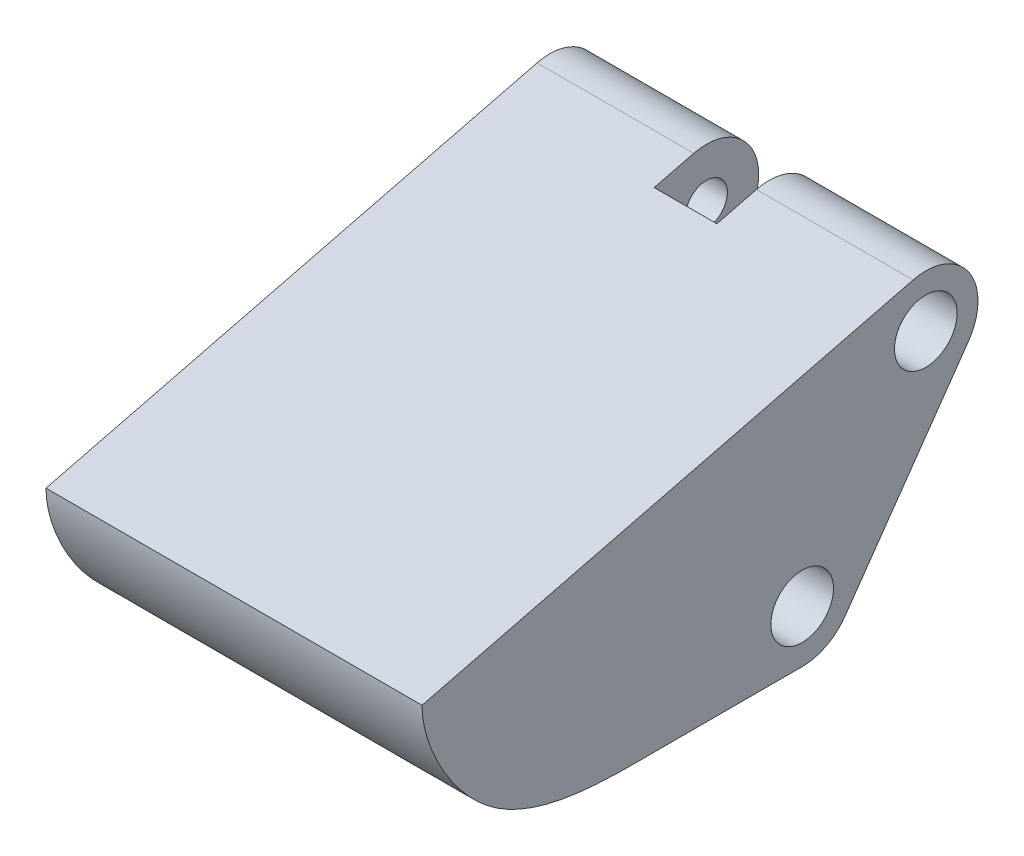
ISO-10303-21;
HEADER;
FILE_DESCRIPTION(('STEP AP214'),'2;1');
FILE_NAME('part.step','',(''),(''),'','','');
FILE_SCHEMA(('AUTOMOTIVE_DESIGN { 1 0 10303 214 1 1 1 1 }'));
ENDSEC;
DATA;
#1=APPLICATION_CONTEXT('core data for automotive mechanical design processes');
#2=APPLICATION_PROTOCOL_DEFINITION('international standard','automotive_design',2000,#1);
#3=PRODUCT_CONTEXT('',#1,'mechanical');
#4=PRODUCT('Part','Part','',(#3));
#5=PRODUCT_RELATED_PRODUCT_CATEGORY('part','',(#4));
#6=PRODUCT_DEFINITION_FORMATION('','',#4);
#7=PRODUCT_DEFINITION_CONTEXT('part definition',#1,'design');
#8=PRODUCT_DEFINITION('design','',#6,#7);
#9=PRODUCT_DEFINITION_SHAPE('','',#8);
#10=(LENGTH_UNIT() NAMED_UNIT(*) SI_UNIT(.MILLI.,.METRE.));
#11=(NAMED_UNIT(*) PLANE_ANGLE_UNIT() SI_UNIT($,.RADIAN.));
#12=(NAMED_UNIT(*) SI_UNIT($,.STERADIAN.) SOLID_ANGLE_UNIT());
#13=UNCERTAINTY_MEASURE_WITH_UNIT(LENGTH_MEASURE(1.E-05),#10,'distance_accuracy_value','');
#14=(GEOMETRIC_REPRESENTATION_CONTEXT(3) GLOBAL_UNCERTAINTY_ASSIGNED_CONTEXT((#13)) GLOBAL_UNIT_ASSIGNED_CONTEXT((#10,
#11,#12)) REPRESENTATION_CONTEXT('',''));
#15=CARTESIAN_POINT('',(0.,0.,0.));
#16=DIRECTION('',(0.,0.,1.));
#17=DIRECTION('',(1.,0.,0.));
#18=AXIS2_PLACEMENT_3D('',#15,#16,#17);
#19=CARTESIAN_POINT('',(9.,-5.00000000000001,11.8016389039334));
#20=DIRECTION('',(-1.,0.,0.));
#21=DIRECTION('',(0.,0.,1.));
#22=AXIS2_PLACEMENT_3D('',#19,#20,#21);
#23=CYLINDRICAL_SURFACE('',#22,1.);
#24=CARTESIAN_POINT('',(-3.,-5.00000000000001,11.8016389039334));
#25=DIRECTION('',(-1.,0.,0.));
#26=DIRECTION('',(0.,0.,1.));
#27=AXIS2_PLACEMENT_3D('',#24,#25,#26);
#28=CIRCLE('',#27,1.);
#29=CARTESIAN_POINT('',(-3.,-5.00000000000001,12.8016389039334));
#30=VERTEX_POINT('',#29);
#31=EDGE_CURVE('E192',#30,#30,#28,.T.);
#32=ORIENTED_EDGE('',*,*,#31,.F.);
#33=EDGE_LOOP('',(#32));
#34=FACE_BOUND('',#33,.T.);
#35=CARTESIAN_POINT('',(-6.,-5.00000000000001,11.8016389039334));
#36=DIRECTION('',(-1.,0.,0.));
#37=DIRECTION('',(0.,0.,1.));
#38=AXIS2_PLACEMENT_3D('',#35,#36,#37);
#39=CIRCLE('',#38,1.);
#40=CARTESIAN_POINT('',(-6.,-5.00000000000001,12.8016389039334));
#41=VERTEX_POINT('',#40);
#42=EDGE_CURVE('E49',#41,#41,#39,.T.);
#43=ORIENTED_EDGE('',*,*,#42,.T.);
#44=EDGE_LOOP('',(#43));
#45=FACE_BOUND('',#44,.T.);
#46=ADVANCED_FACE('F45',(#34,#45),#23,.F.);
#47=CARTESIAN_POINT('',(9.,3.45169607030982,5.88545165471655));
#48=DIRECTION('',(-1.,0.,0.));
#49=DIRECTION('',(0.,0.,1.));
#50=AXIS2_PLACEMENT_3D('',#47,#48,#49);
#51=CYLINDRICAL_SURFACE('',#50,1.);
#52=CARTESIAN_POINT('',(-1.5,3.45169607030982,5.88545165471655));
#53=DIRECTION('',(-1.,0.,0.));
#54=DIRECTION('',(0.,0.,1.));
#55=AXIS2_PLACEMENT_3D('',#52,#53,#54);
#56=CIRCLE('',#55,1.);
#57=CARTESIAN_POINT('',(-1.5,3.45169607030982,6.88545165471655));
#58=VERTEX_POINT('',#57);
#59=EDGE_CURVE('E292',#58,#58,#56,.T.);
#60=ORIENTED_EDGE('',*,*,#59,.F.);
#61=EDGE_LOOP('',(#60));
#62=FACE_BOUND('',#61,.T.);
#63=CARTESIAN_POINT('',(-6.,3.45169607030982,5.88545165471655));
#64=DIRECTION('',(-1.,0.,0.));
#65=DIRECTION('',(0.,0.,1.));
#66=AXIS2_PLACEMENT_3D('',#63,#64,#65);
#67=CIRCLE('',#66,1.);
#68=CARTESIAN_POINT('',(-6.,3.45169607030982,6.88545165471655));
#69=VERTEX_POINT('',#68);
#70=EDGE_CURVE('E203',#69,#69,#67,.T.);
#71=ORIENTED_EDGE('',*,*,#70,.T.);
#72=EDGE_LOOP('',(#71));
#73=FACE_BOUND('',#72,.T.);
#74=ADVANCED_FACE('F316',(#62,#73),#51,.F.);
#75=CARTESIAN_POINT('',(1.5,3.45169607030982,5.88545165471655));
#76=DIRECTION('',(1.,0.,0.));
#77=DIRECTION('',(0.,0.,-1.));
#78=AXIS2_PLACEMENT_3D('',#75,#76,#77);
#79=CIRCLE('',#78,1.);
#80=CARTESIAN_POINT('',(1.5,3.45169607030982,4.88545165471655));
#81=VERTEX_POINT('',#80);
#82=EDGE_CURVE('E284',#81,#81,#79,.T.);
#83=ORIENTED_EDGE('',*,*,#82,.F.);
#84=EDGE_LOOP('',(#83));
#85=FACE_BOUND('',#84,.T.);
#86=CARTESIAN_POINT('',(6.,3.45169607030982,5.88545165471655));
#87=DIRECTION('',(1.,0.,0.));
#88=DIRECTION('',(0.,0.,-1.));
#89=AXIS2_PLACEMENT_3D('',#86,#87,#88);
#90=CIRCLE('',#89,1.);
#91=CARTESIAN_POINT('',(6.,3.45169607030982,4.88545165471655));
#92=VERTEX_POINT('',#91);
#93=EDGE_CURVE('E199',#92,#92,#90,.T.);
#94=ORIENTED_EDGE('',*,*,#93,.T.);
#95=EDGE_LOOP('',(#94));
#96=FACE_BOUND('',#95,.T.);
#97=ADVANCED_FACE('F314',(#85,#96),#51,.F.);
#98=CARTESIAN_POINT('',(3.,-5.00000000000001,11.8016389039334));
#99=DIRECTION('',(1.,0.,0.));
#100=DIRECTION('',(0.,0.,-1.));
#101=AXIS2_PLACEMENT_3D('',#98,#99,#100);
#102=CIRCLE('',#101,1.);
#103=CARTESIAN_POINT('',(3.,-5.00000000000001,10.8016389039334));
#104=VERTEX_POINT('',#103);
#105=EDGE_CURVE('E187',#104,#104,#102,.T.);
#106=ORIENTED_EDGE('',*,*,#105,.F.);
#107=EDGE_LOOP('',(#106));
#108=FACE_BOUND('',#107,.T.);
#109=CARTESIAN_POINT('',(6.,-5.00000000000001,11.8016389039334));
#110=DIRECTION('',(1.,0.,0.));
#111=DIRECTION('',(0.,0.,-1.));
#112=AXIS2_PLACEMENT_3D('',#109,#110,#111);
#113=CIRCLE('',#112,1.);
#114=CARTESIAN_POINT('',(6.,-5.00000000000001,10.8016389039334));
#115=VERTEX_POINT('',#114);
#116=EDGE_CURVE('E196',#115,#115,#113,.T.);
#117=ORIENTED_EDGE('',*,*,#116,.T.);
#118=EDGE_LOOP('',(#117));
#119=FACE_BOUND('',#118,.T.);
#120=ADVANCED_FACE('F47',(#108,#119),#23,.F.);
#121=CARTESIAN_POINT('',(9.,-5.,11.8016389039334));
#122=DIRECTION('',(-1.,0.,0.));
#123=DIRECTION('',(0.,0.,1.));
#124=AXIS2_PLACEMENT_3D('',#121,#122,#123);
#125=CYLINDRICAL_SURFACE('',#124,2.5);
#126=CARTESIAN_POINT('',(-3.,-5.,11.8016389039334));
#127=DIRECTION('',(-1.,0.,0.));
#128=DIRECTION('',(0.,0.,1.));
#129=AXIS2_PLACEMENT_3D('',#126,#127,#128);
#130=CIRCLE('',#129,2.5);
#131=CARTESIAN_POINT('',(-3.,-7.50000000000001,11.8016389039334));
#132=VERTEX_POINT('',#131);
#133=CARTESIAN_POINT('',(-3.,-6.43365586090832,9.75355910263582));
#134=VERTEX_POINT('',#133);
#135=EDGE_CURVE('E269',#132,#134,#130,.F.);
#136=ORIENTED_EDGE('',*,*,#135,.F.);
#137=DIRECTION('',(-1.,0.,0.));
#138=VECTOR('',#137,1.);
#139=CARTESIAN_POINT('',(9.,-7.50000000000001,11.8016389039334));
#140=LINE('',#139,#138);
#141=CARTESIAN_POINT('',(-9.,-7.50000000000001,11.8016389039334));
#142=VERTEX_POINT('',#141);
#143=EDGE_CURVE('E131',#132,#142,#140,.T.);
#144=ORIENTED_EDGE('',*,*,#143,.T.);
#145=CARTESIAN_POINT('',(-9.,-5.,11.8016389039334));
#146=DIRECTION('',(1.,0.,0.));
#147=DIRECTION('',(0.,0.,-1.));
#148=AXIS2_PLACEMENT_3D('',#145,#146,#147);
#149=CIRCLE('',#148,2.5);
#150=CARTESIAN_POINT('',(-9.,-6.43365586090832,9.75355910263582));
#151=VERTEX_POINT('',#150);
#152=EDGE_CURVE('E161',#151,#142,#149,.F.);
#153=ORIENTED_EDGE('',*,*,#152,.F.);
#154=DIRECTION('',(-1.,0.,0.));
#155=VECTOR('',#154,1.);
#156=CARTESIAN_POINT('',(9.,-6.43365586090832,9.75355910263582));
#157=LINE('',#156,#155);
#158=EDGE_CURVE('E132',#134,#151,#157,.T.);
#159=ORIENTED_EDGE('',*,*,#158,.F.);
#160=EDGE_LOOP('',(#136,#144,#153,#159));
#161=FACE_BOUND('',#160,.T.);
#162=ADVANCED_FACE('F322',(#161),#125,.T.);
#163=CARTESIAN_POINT('',(9.,2.46644295302013,3.5234899328859));
#164=DIRECTION('',(0.,-0.573462344363328,-0.81923192051904));
#165=DIRECTION('',(0.,0.81923192051904,-0.573462344363328));
#166=AXIS2_PLACEMENT_3D('',#163,#164,#165);
#167=PLANE('',#166);
#168=DIRECTION('',(0.,0.819231920519041,-0.573462344363328));
#169=VECTOR('',#168,1.);
#170=CARTESIAN_POINT('',(-3.,2.46644295302013,3.5234899328859));
#171=LINE('',#170,#169);
#172=CARTESIAN_POINT('',(-3.,-2.25,6.825));
#173=VERTEX_POINT('',#172);
#174=EDGE_CURVE('E195',#134,#173,#171,.T.);
#175=ORIENTED_EDGE('',*,*,#174,.F.);
#176=ORIENTED_EDGE('',*,*,#158,.T.);
#177=DIRECTION('',(0.,-0.81923192051904,0.573462344363328));
#178=VECTOR('',#177,1.);
#179=CARTESIAN_POINT('',(-9.,2.46644295302013,3.5234899328859));
#180=LINE('',#179,#178);
#181=CARTESIAN_POINT('',(-9.,2.0180402094015,3.83737185341895));
#182=VERTEX_POINT('',#181);
#183=EDGE_CURVE('E164',#182,#151,#180,.T.);
#184=ORIENTED_EDGE('',*,*,#183,.F.);
#185=DIRECTION('',(-1.,0.,0.));
#186=VECTOR('',#185,1.);
#187=CARTESIAN_POINT('',(9.,2.0180402094015,3.83737185341895));
#188=LINE('',#187,#186);
#189=CARTESIAN_POINT('',(-1.5,2.0180402094015,3.83737185341895));
#190=VERTEX_POINT('',#189);
#191=EDGE_CURVE('E173',#190,#182,#188,.T.);
#192=ORIENTED_EDGE('',*,*,#191,.F.);
#193=DIRECTION('',(0.,0.81923192051904,-0.573462344363328));
#194=VECTOR('',#193,1.);
#195=CARTESIAN_POINT('',(-1.5,2.46644295302013,3.5234899328859));
#196=LINE('',#195,#194);
#197=CARTESIAN_POINT('',(-1.5,-2.25,6.825));
#198=VERTEX_POINT('',#197);
#199=EDGE_CURVE('E287',#198,#190,#196,.T.);
#200=ORIENTED_EDGE('',*,*,#199,.F.);
#201=DIRECTION('',(1.,0.,0.));
#202=VECTOR('',#201,1.);
#203=CARTESIAN_POINT('',(9.,-2.25,6.825));
#204=LINE('',#203,#202);
#205=EDGE_CURVE('E191',#173,#198,#204,.T.);
#206=ORIENTED_EDGE('',*,*,#205,.F.);
#207=EDGE_LOOP('',(#175,#176,#184,#192,#200,#206));
#208=FACE_BOUND('',#207,.T.);
#209=ADVANCED_FACE('F402',(#208),#167,.T.);
#210=CARTESIAN_POINT('',(9.,3.45169607030982,5.88545165471655));
#211=DIRECTION('',(-1.,0.,0.));
#212=DIRECTION('',(0.,0.,1.));
#213=AXIS2_PLACEMENT_3D('',#210,#211,#212);
#214=CYLINDRICAL_SURFACE('',#213,2.5);
#215=DIRECTION('',(-1.,0.,0.));
#216=VECTOR('',#215,1.);
#217=CARTESIAN_POINT('',(9.,5.87705232067315,6.49179071730738));
#218=LINE('',#217,#216);
#219=CARTESIAN_POINT('',(-1.5,5.87705232067315,6.49179071730738));
#220=VERTEX_POINT('',#219);
#221=CARTESIAN_POINT('',(-9.,5.87705232067315,6.49179071730738));
#222=VERTEX_POINT('',#221);
#223=EDGE_CURVE('E99',#220,#222,#218,.T.);
#224=ORIENTED_EDGE('',*,*,#223,.F.);
#225=CARTESIAN_POINT('',(-1.5,3.45169607030982,5.88545165471655));
#226=DIRECTION('',(-1.,0.,0.));
#227=DIRECTION('',(0.,0.,1.));
#228=AXIS2_PLACEMENT_3D('',#225,#226,#227);
#229=CIRCLE('',#228,2.5);
#230=EDGE_CURVE('E54',#220,#190,#229,.T.);
#231=ORIENTED_EDGE('',*,*,#230,.T.);
#232=ORIENTED_EDGE('',*,*,#191,.T.);
#233=CARTESIAN_POINT('',(-9.,3.45169607030982,5.88545165471655));
#234=DIRECTION('',(1.,0.,0.));
#235=DIRECTION('',(0.,0.,-1.));
#236=AXIS2_PLACEMENT_3D('',#233,#234,#235);
#237=CIRCLE('',#236,2.5);
#238=EDGE_CURVE('E167',#182,#222,#237,.T.);
#239=ORIENTED_EDGE('',*,*,#238,.T.);
#240=EDGE_LOOP('',(#224,#231,#232,#239));
#241=FACE_BOUND('',#240,.T.);
#242=ADVANCED_FACE('F313',(#241),#214,.T.);
#243=CARTESIAN_POINT('',(9.,7.05882352941176,1.76470588235294));
#244=DIRECTION('',(0.,-0.970142500145332,-0.242535625036333));
#245=DIRECTION('',(0.,0.242535625036333,-0.970142500145332));
#246=AXIS2_PLACEMENT_3D('',#243,#244,#245);
#247=PLANE('',#246);
#248=DIRECTION('',(-1.,0.,0.));
#249=VECTOR('',#248,1.);
#250=CARTESIAN_POINT('',(9.,5.40363708632086,8.38545165471655));
#251=LINE('',#250,#249);
#252=CARTESIAN_POINT('',(1.5,5.40363708632086,8.38545165471655));
#253=VERTEX_POINT('',#252);
#254=CARTESIAN_POINT('',(-1.5,5.40363708632086,8.38545165471655));
#255=VERTEX_POINT('',#254);
#256=EDGE_CURVE('E151',#253,#255,#251,.T.);
#257=ORIENTED_EDGE('',*,*,#256,.T.);
#258=DIRECTION('',(0.,0.242535625036333,-0.970142500145332));
#259=VECTOR('',#258,1.);
#260=CARTESIAN_POINT('',(-1.5,7.05882352941176,1.76470588235294));
#261=LINE('',#260,#259);
#262=EDGE_CURVE('E290',#255,#220,#261,.T.);
#263=ORIENTED_EDGE('',*,*,#262,.T.);
#264=ORIENTED_EDGE('',*,*,#223,.T.);
#265=DIRECTION('',(0.,-0.242535625036333,0.970142500145332));
#266=VECTOR('',#265,1.);
#267=CARTESIAN_POINT('',(-9.,7.05882352941176,1.76470588235294));
#268=LINE('',#267,#266);
#269=CARTESIAN_POINT('',(-9.,0.,30.));
#270=VERTEX_POINT('',#269);
#271=EDGE_CURVE('E148',#222,#270,#268,.T.);
#272=ORIENTED_EDGE('',*,*,#271,.T.);
#273=DIRECTION('',(-1.,0.,0.));
#274=VECTOR('',#273,1.);
#275=CARTESIAN_POINT('',(9.,0.,30.));
#276=LINE('',#275,#274);
#277=CARTESIAN_POINT('',(9.,0.,30.));
#278=VERTEX_POINT('',#277);
#279=EDGE_CURVE('E180',#278,#270,#276,.T.);
#280=ORIENTED_EDGE('',*,*,#279,.F.);
#281=DIRECTION('',(0.,-0.242535625036333,0.970142500145332));
#282=VECTOR('',#281,1.);
#283=CARTESIAN_POINT('',(9.,7.05882352941176,1.76470588235294));
#284=LINE('',#283,#282);
#285=CARTESIAN_POINT('',(9.,5.87705232067315,6.49179071730738));
#286=VERTEX_POINT('',#285);
#287=EDGE_CURVE('E169',#286,#278,#284,.T.);
#288=ORIENTED_EDGE('',*,*,#287,.F.);
#289=CARTESIAN_POINT('',(1.5,5.87705232067315,6.49179071730738));
#290=VERTEX_POINT('',#289);
#291=EDGE_CURVE('E170',#286,#290,#218,.T.);
#292=ORIENTED_EDGE('',*,*,#291,.T.);
#293=DIRECTION('',(0.,-0.242535625036333,0.970142500145332));
#294=VECTOR('',#293,1.);
#295=CARTESIAN_POINT('',(1.5,7.05882352941176,1.76470588235294));
#296=LINE('',#295,#294);
#297=EDGE_CURVE('E281',#290,#253,#296,.T.);
#298=ORIENTED_EDGE('',*,*,#297,.T.);
#299=EDGE_LOOP('',(#257,#263,#264,#272,#280,#288,#292,#298));
#300=FACE_BOUND('',#299,.T.);
#301=ADVANCED_FACE('F310',(#300),#247,.F.);
#302=CARTESIAN_POINT('',(9.,0.,30.));
#303=CARTESIAN_POINT('',(9.,-1.82510775769576,30.));
#304=CARTESIAN_POINT('',(9.,-7.80596294742245,26.893202647843));
#305=CARTESIAN_POINT('',(9.,-7.5,20.772810337284));
#306=CARTESIAN_POINT('',(9.,-7.5,18.5));
#307=B_SPLINE_CURVE_WITH_KNOTS('',3,(#302,#303,#304,#305,#306),.UNSPECIFIED.,.F.,.F.,(4,1,4),
(0.,0.460452824244681,1.),.UNSPECIFIED.);
#308=DIRECTION('',(-1.,0.,0.));
#309=VECTOR('',#308,1.);
#310=SURFACE_OF_LINEAR_EXTRUSION('',#307,#309);
#311=CARTESIAN_POINT('',(-9.,0.,30.));
#312=CARTESIAN_POINT('',(-9.,-1.82510775769576,30.));
#313=CARTESIAN_POINT('',(-9.,-7.80596294742245,26.893202647843));
#314=CARTESIAN_POINT('',(-9.,-7.5,20.772810337284));
#315=CARTESIAN_POINT('',(-9.,-7.5,18.5));
#316=B_SPLINE_CURVE_WITH_KNOTS('',3,(#311,#312,#313,#314,#315),.UNSPECIFIED.,.F.,.F.,(4,1,4),
(0.,0.460452824244681,1.),.UNSPECIFIED.);
#317=CARTESIAN_POINT('',(-9.,-7.50000000000001,18.5));
#318=VERTEX_POINT('',#317);
#319=EDGE_CURVE('E150',#270,#318,#316,.T.);
#320=ORIENTED_EDGE('',*,*,#319,.T.);
#321=DIRECTION('',(-1.,0.,0.));
#322=VECTOR('',#321,1.);
#323=CARTESIAN_POINT('',(9.,-7.50000000000001,18.5));
#324=LINE('',#323,#322);
#325=CARTESIAN_POINT('',(9.,-7.50000000000001,18.5));
#326=VERTEX_POINT('',#325);
#327=EDGE_CURVE('E177',#326,#318,#324,.T.);
#328=ORIENTED_EDGE('',*,*,#327,.F.);
#329=EDGE_CURVE('E108',#278,#326,#307,.T.);
#330=ORIENTED_EDGE('',*,*,#329,.F.);
#331=ORIENTED_EDGE('',*,*,#279,.T.);
#332=EDGE_LOOP('',(#320,#328,#330,#331));
#333=FACE_BOUND('',#332,.T.);
#334=ADVANCED_FACE('F305',(#333),#310,.F.);
#335=CARTESIAN_POINT('',(9.,-7.5,0.));
#336=DIRECTION('',(0.,1.,0.));
#337=DIRECTION('',(0.,0.,1.));
#338=AXIS2_PLACEMENT_3D('',#335,#336,#337);
#339=PLANE('',#338);
#340=ORIENTED_EDGE('',*,*,#143,.F.);
#341=DIRECTION('',(0.,0.,-1.));
#342=VECTOR('',#341,1.);
#343=CARTESIAN_POINT('',(-3.,-7.5,5.80163890393343));
#344=LINE('',#343,#342);
#345=CARTESIAN_POINT('',(-3.,-7.50000000000001,15.8016389039334));
#346=VERTEX_POINT('',#345);
#347=EDGE_CURVE('E202',#346,#132,#344,.T.);
#348=ORIENTED_EDGE('',*,*,#347,.F.);
#349=DIRECTION('',(-1.,0.,0.));
#350=VECTOR('',#349,1.);
#351=CARTESIAN_POINT('',(-3.,-7.50000000000001,15.8016389039334));
#352=LINE('',#351,#350);
#353=CARTESIAN_POINT('',(3.,-7.50000000000001,15.8016389039334));
#354=VERTEX_POINT('',#353);
#355=EDGE_CURVE('E238',#354,#346,#352,.T.);
#356=ORIENTED_EDGE('',*,*,#355,.F.);
#357=DIRECTION('',(0.,0.,1.));
#358=VECTOR('',#357,1.);
#359=CARTESIAN_POINT('',(3.,-7.5,5.80163890393343));
#360=LINE('',#359,#358);
#361=CARTESIAN_POINT('',(3.,-7.50000000000001,11.8016389039334));
#362=VERTEX_POINT('',#361);
#363=EDGE_CURVE('E247',#362,#354,#360,.T.);
#364=ORIENTED_EDGE('',*,*,#363,.F.);
#365=CARTESIAN_POINT('',(9.,-7.50000000000001,11.8016389039334));
#366=VERTEX_POINT('',#365);
#367=EDGE_CURVE('E175',#366,#362,#140,.T.);
#368=ORIENTED_EDGE('',*,*,#367,.F.);
#369=DIRECTION('',(0.,0.,-1.));
#370=VECTOR('',#369,1.);
#371=CARTESIAN_POINT('',(9.,-7.5,0.));
#372=LINE('',#371,#370);
#373=EDGE_CURVE('E137',#326,#366,#372,.T.);
#374=ORIENTED_EDGE('',*,*,#373,.F.);
#375=ORIENTED_EDGE('',*,*,#327,.T.);
#376=DIRECTION('',(0.,0.,-1.));
#377=VECTOR('',#376,1.);
#378=CARTESIAN_POINT('',(-9.,-7.5,0.));
#379=LINE('',#378,#377);
#380=EDGE_CURVE('E155',#318,#142,#379,.T.);
#381=ORIENTED_EDGE('',*,*,#380,.T.);
#382=EDGE_LOOP('',(#340,#348,#356,#364,#368,#374,#375,#381));
#383=FACE_BOUND('',#382,.T.);
#384=ADVANCED_FACE('F309',(#383),#339,.F.);
#385=CARTESIAN_POINT('',(3.,-5.,11.8016389039334));
#386=DIRECTION('',(1.,0.,0.));
#387=DIRECTION('',(0.,0.,-1.));
#388=AXIS2_PLACEMENT_3D('',#385,#386,#387);
#389=CIRCLE('',#388,2.5);
#390=CARTESIAN_POINT('',(3.,-6.43365586090832,9.75355910263582));
#391=VERTEX_POINT('',#390);
#392=EDGE_CURVE('E127',#391,#362,#389,.F.);
#393=ORIENTED_EDGE('',*,*,#392,.F.);
#394=CARTESIAN_POINT('',(9.,-6.43365586090832,9.75355910263582));
#395=VERTEX_POINT('',#394);
#396=EDGE_CURVE('E120',#395,#391,#157,.T.);
#397=ORIENTED_EDGE('',*,*,#396,.F.);
#398=CARTESIAN_POINT('',(9.,-5.,11.8016389039334));
#399=DIRECTION('',(1.,0.,0.));
#400=DIRECTION('',(0.,0.,-1.));
#401=AXIS2_PLACEMENT_3D('',#398,#399,#400);
#402=CIRCLE('',#401,2.5);
#403=EDGE_CURVE('E124',#395,#366,#402,.F.);
#404=ORIENTED_EDGE('',*,*,#403,.T.);
#405=ORIENTED_EDGE('',*,*,#367,.T.);
#406=EDGE_LOOP('',(#393,#397,#404,#405));
#407=FACE_BOUND('',#406,.T.);
#408=ADVANCED_FACE('F122',(#407),#125,.T.);
#409=DIRECTION('',(0.,-0.819231920519041,0.573462344363328));
#410=VECTOR('',#409,1.);
#411=CARTESIAN_POINT('',(3.,2.46644295302013,3.5234899328859));
#412=LINE('',#411,#410);
#413=CARTESIAN_POINT('',(3.,-2.25,6.825));
#414=VERTEX_POINT('',#413);
#415=EDGE_CURVE('E190',#414,#391,#412,.T.);
#416=ORIENTED_EDGE('',*,*,#415,.F.);
#417=CARTESIAN_POINT('',(1.5,-2.25,6.825));
#418=VERTEX_POINT('',#417);
#419=EDGE_CURVE('E258',#418,#414,#204,.T.);
#420=ORIENTED_EDGE('',*,*,#419,.F.);
#421=DIRECTION('',(0.,-0.81923192051904,0.573462344363328));
#422=VECTOR('',#421,1.);
#423=CARTESIAN_POINT('',(1.5,2.46644295302013,3.5234899328859));
#424=LINE('',#423,#422);
#425=CARTESIAN_POINT('',(1.5,2.0180402094015,3.83737185341895));
#426=VERTEX_POINT('',#425);
#427=EDGE_CURVE('E276',#426,#418,#424,.T.);
#428=ORIENTED_EDGE('',*,*,#427,.F.);
#429=CARTESIAN_POINT('',(9.,2.0180402094015,3.83737185341895));
#430=VERTEX_POINT('',#429);
#431=EDGE_CURVE('E143',#430,#426,#188,.T.);
#432=ORIENTED_EDGE('',*,*,#431,.F.);
#433=DIRECTION('',(0.,-0.81923192051904,0.573462344363328));
#434=VECTOR('',#433,1.);
#435=CARTESIAN_POINT('',(9.,2.46644295302013,3.5234899328859));
#436=LINE('',#435,#434);
#437=EDGE_CURVE('E135',#430,#395,#436,.T.);
#438=ORIENTED_EDGE('',*,*,#437,.T.);
#439=ORIENTED_EDGE('',*,*,#396,.T.);
#440=EDGE_LOOP('',(#416,#420,#428,#432,#438,#439));
#441=FACE_BOUND('',#440,.T.);
#442=ADVANCED_FACE('F140',(#441),#167,.T.);
#443=ORIENTED_EDGE('',*,*,#431,.T.);
#444=CARTESIAN_POINT('',(1.5,3.45169607030982,5.88545165471655));
#445=DIRECTION('',(1.,0.,0.));
#446=DIRECTION('',(0.,0.,-1.));
#447=AXIS2_PLACEMENT_3D('',#444,#445,#446);
#448=CIRCLE('',#447,2.5);
#449=EDGE_CURVE('E182',#426,#290,#448,.T.);
#450=ORIENTED_EDGE('',*,*,#449,.T.);
#451=ORIENTED_EDGE('',*,*,#291,.F.);
#452=CARTESIAN_POINT('',(9.,3.45169607030982,5.88545165471655));
#453=DIRECTION('',(1.,0.,0.));
#454=DIRECTION('',(0.,0.,-1.));
#455=AXIS2_PLACEMENT_3D('',#452,#453,#454);
#456=CIRCLE('',#455,2.5);
#457=EDGE_CURVE('E70',#430,#286,#456,.T.);
#458=ORIENTED_EDGE('',*,*,#457,.F.);
#459=EDGE_LOOP('',(#443,#450,#451,#458));
#460=FACE_BOUND('',#459,.T.);
#461=ADVANCED_FACE('F441',(#460),#214,.T.);
#462=CARTESIAN_POINT('',(9.,0.,0.));
#463=DIRECTION('',(1.,0.,0.));
#464=DIRECTION('',(0.,0.,-1.));
#465=AXIS2_PLACEMENT_3D('',#462,#463,#464);
#466=PLANE('',#465);
#467=CARTESIAN_POINT('',(9.,3.45169607030982,5.88545165471655));
#468=DIRECTION('',(1.,0.,0.));
#469=DIRECTION('',(0.,0.,-1.));
#470=AXIS2_PLACEMENT_3D('',#467,#468,#469);
#471=CIRCLE('',#470,1.5);
#472=CARTESIAN_POINT('',(9.,3.45169607030982,4.38545165471655));
#473=VERTEX_POINT('',#472);
#474=EDGE_CURVE('E226',#473,#473,#471,.T.);
#475=ORIENTED_EDGE('',*,*,#474,.F.);
#476=EDGE_LOOP('',(#475));
#477=FACE_BOUND('',#476,.T.);
#478=CARTESIAN_POINT('',(9.,-5.00000000000001,11.8016389039334));
#479=DIRECTION('',(1.,0.,0.));
#480=DIRECTION('',(0.,0.,-1.));
#481=AXIS2_PLACEMENT_3D('',#478,#479,#480);
#482=CIRCLE('',#481,1.5);
#483=CARTESIAN_POINT('',(9.,-5.00000000000001,10.3016389039334));
#484=VERTEX_POINT('',#483);
#485=EDGE_CURVE('E229',#484,#484,#482,.T.);
#486=ORIENTED_EDGE('',*,*,#485,.F.);
#487=EDGE_LOOP('',(#486));
#488=FACE_BOUND('',#487,.T.);
#489=ORIENTED_EDGE('',*,*,#287,.T.);
#490=ORIENTED_EDGE('',*,*,#329,.T.);
#491=ORIENTED_EDGE('',*,*,#373,.T.);
#492=ORIENTED_EDGE('',*,*,#403,.F.);
#493=ORIENTED_EDGE('',*,*,#437,.F.);
#494=ORIENTED_EDGE('',*,*,#457,.T.);
#495=EDGE_LOOP('',(#489,#490,#491,#492,#493,#494));
#496=FACE_BOUND('',#495,.T.);
#497=ADVANCED_FACE('F134',(#477,#488,#496),#466,.T.);
#498=CARTESIAN_POINT('',(-9.,0.,0.));
#499=DIRECTION('',(1.,0.,0.));
#500=DIRECTION('',(0.,0.,-1.));
#501=AXIS2_PLACEMENT_3D('',#498,#499,#500);
#502=PLANE('',#501);
#503=CARTESIAN_POINT('',(-9.,3.45169607030982,5.88545165471655));
#504=DIRECTION('',(-1.,0.,0.));
#505=DIRECTION('',(0.,0.,1.));
#506=AXIS2_PLACEMENT_3D('',#503,#504,#505);
#507=CIRCLE('',#506,1.5);
#508=CARTESIAN_POINT('',(-9.,3.45169607030982,7.38545165471655));
#509=VERTEX_POINT('',#508);
#510=EDGE_CURVE('E211',#509,#509,#507,.T.);
#511=ORIENTED_EDGE('',*,*,#510,.F.);
#512=EDGE_LOOP('',(#511));
#513=FACE_BOUND('',#512,.T.);
#514=CARTESIAN_POINT('',(-9.,-5.00000000000001,11.8016389039334));
#515=DIRECTION('',(-1.,0.,0.));
#516=DIRECTION('',(0.,0.,1.));
#517=AXIS2_PLACEMENT_3D('',#514,#515,#516);
#518=CIRCLE('',#517,1.5);
#519=CARTESIAN_POINT('',(-9.,-5.00000000000001,13.3016389039334));
#520=VERTEX_POINT('',#519);
#521=EDGE_CURVE('E216',#520,#520,#518,.T.);
#522=ORIENTED_EDGE('',*,*,#521,.F.);
#523=EDGE_LOOP('',(#522));
#524=FACE_BOUND('',#523,.T.);
#525=ORIENTED_EDGE('',*,*,#271,.F.);
#526=ORIENTED_EDGE('',*,*,#238,.F.);
#527=ORIENTED_EDGE('',*,*,#183,.T.);
#528=ORIENTED_EDGE('',*,*,#152,.T.);
#529=ORIENTED_EDGE('',*,*,#380,.F.);
#530=ORIENTED_EDGE('',*,*,#319,.F.);
#531=EDGE_LOOP('',(#525,#526,#527,#528,#529,#530));
#532=FACE_BOUND('',#531,.T.);
#533=ADVANCED_FACE('F351',(#513,#524,#532),#502,.F.);
#534=CARTESIAN_POINT('',(1.5,-9.04830392969018,8.38545165471655));
#535=DIRECTION('',(0.,0.,1.));
#536=DIRECTION('',(1.,0.,0.));
#537=AXIS2_PLACEMENT_3D('',#534,#535,#536);
#538=PLANE('',#537);
#539=DIRECTION('',(0.,1.,0.));
#540=VECTOR('',#539,1.);
#541=CARTESIAN_POINT('',(1.5,-9.04830392969018,8.38545165471655));
#542=LINE('',#541,#540);
#543=CARTESIAN_POINT('',(1.5,-2.25,8.38545165471655));
#544=VERTEX_POINT('',#543);
#545=EDGE_CURVE('E273',#544,#253,#542,.T.);
#546=ORIENTED_EDGE('',*,*,#545,.F.);
#547=DIRECTION('',(-1.,0.,0.));
#548=VECTOR('',#547,1.);
#549=CARTESIAN_POINT('',(1.5,-2.25,8.38545165471655));
#550=LINE('',#549,#548);
#551=CARTESIAN_POINT('',(-1.5,-2.25,8.38545165471655));
#552=VERTEX_POINT('',#551);
#553=EDGE_CURVE('E62',#544,#552,#550,.T.);
#554=ORIENTED_EDGE('',*,*,#553,.T.);
#555=DIRECTION('',(0.,1.,0.));
#556=VECTOR('',#555,1.);
#557=CARTESIAN_POINT('',(-1.5,-9.04830392969018,8.38545165471655));
#558=LINE('',#557,#556);
#559=EDGE_CURVE('E272',#552,#255,#558,.T.);
#560=ORIENTED_EDGE('',*,*,#559,.T.);
#561=ORIENTED_EDGE('',*,*,#256,.F.);
#562=EDGE_LOOP('',(#546,#554,#560,#561));
#563=FACE_BOUND('',#562,.T.);
#564=ADVANCED_FACE('F354',(#563),#538,.F.);
#565=CARTESIAN_POINT('',(-1.5,-9.04830392969018,8.38545165471655));
#566=DIRECTION('',(-1.,0.,0.));
#567=DIRECTION('',(0.,0.,1.));
#568=AXIS2_PLACEMENT_3D('',#565,#566,#567);
#569=PLANE('',#568);
#570=ORIENTED_EDGE('',*,*,#59,.T.);
#571=EDGE_LOOP('',(#570));
#572=FACE_BOUND('',#571,.T.);
#573=ORIENTED_EDGE('',*,*,#559,.F.);
#574=DIRECTION('',(0.,0.,-1.));
#575=VECTOR('',#574,1.);
#576=CARTESIAN_POINT('',(-1.5,-2.25,8.38545165471655));
#577=LINE('',#576,#575);
#578=EDGE_CURVE('E261',#552,#198,#577,.T.);
#579=ORIENTED_EDGE('',*,*,#578,.T.);
#580=ORIENTED_EDGE('',*,*,#199,.T.);
#581=ORIENTED_EDGE('',*,*,#230,.F.);
#582=ORIENTED_EDGE('',*,*,#262,.F.);
#583=EDGE_LOOP('',(#573,#579,#580,#581,#582));
#584=FACE_BOUND('',#583,.T.);
#585=ADVANCED_FACE('F396',(#572,#584),#569,.F.);
#586=CARTESIAN_POINT('',(1.5,-9.04830392969018,8.38545165471655));
#587=DIRECTION('',(1.,0.,0.));
#588=DIRECTION('',(0.,0.,-1.));
#589=AXIS2_PLACEMENT_3D('',#586,#587,#588);
#590=PLANE('',#589);
#591=ORIENTED_EDGE('',*,*,#82,.T.);
#592=EDGE_LOOP('',(#591));
#593=FACE_BOUND('',#592,.T.);
#594=ORIENTED_EDGE('',*,*,#427,.T.);
#595=DIRECTION('',(0.,0.,1.));
#596=VECTOR('',#595,1.);
#597=CARTESIAN_POINT('',(1.5,-2.25,8.38545165471655));
#598=LINE('',#597,#596);
#599=EDGE_CURVE('E11',#418,#544,#598,.T.);
#600=ORIENTED_EDGE('',*,*,#599,.T.);
#601=ORIENTED_EDGE('',*,*,#545,.T.);
#602=ORIENTED_EDGE('',*,*,#297,.F.);
#603=ORIENTED_EDGE('',*,*,#449,.F.);
#604=EDGE_LOOP('',(#594,#600,#601,#602,#603));
#605=FACE_BOUND('',#604,.T.);
#606=ADVANCED_FACE('F438',(#593,#605),#590,.F.);
#607=CARTESIAN_POINT('',(-3.,-2.25,5.80163890393343));
#608=DIRECTION('',(-1.,0.,0.));
#609=DIRECTION('',(0.,0.,1.));
#610=AXIS2_PLACEMENT_3D('',#607,#608,#609);
#611=PLANE('',#610);
#612=ORIENTED_EDGE('',*,*,#135,.T.);
#613=ORIENTED_EDGE('',*,*,#174,.T.);
#614=DIRECTION('',(0.,0.,-1.));
#615=VECTOR('',#614,1.);
#616=CARTESIAN_POINT('',(-3.,-2.25,5.80163890393343));
#617=LINE('',#616,#615);
#618=CARTESIAN_POINT('',(-3.,-2.25000000000001,15.8016389039334));
#619=VERTEX_POINT('',#618);
#620=EDGE_CURVE('E234',#619,#173,#617,.T.);
#621=ORIENTED_EDGE('',*,*,#620,.F.);
#622=DIRECTION('',(0.,-1.,0.));
#623=VECTOR('',#622,1.);
#624=CARTESIAN_POINT('',(-3.,-2.25000000000001,15.8016389039334));
#625=LINE('',#624,#623);
#626=EDGE_CURVE('E252',#619,#346,#625,.T.);
#627=ORIENTED_EDGE('',*,*,#626,.T.);
#628=ORIENTED_EDGE('',*,*,#347,.T.);
#629=EDGE_LOOP('',(#612,#613,#621,#627,#628));
#630=FACE_BOUND('',#629,.T.);
#631=ORIENTED_EDGE('',*,*,#31,.T.);
#632=EDGE_LOOP('',(#631));
#633=FACE_BOUND('',#632,.T.);
#634=ADVANCED_FACE('F408',(#630,#633),#611,.F.);
#635=CARTESIAN_POINT('',(-3.,-2.25000000000001,15.8016389039334));
#636=DIRECTION('',(0.,0.,1.));
#637=DIRECTION('',(0.,-1.,0.));
#638=AXIS2_PLACEMENT_3D('',#635,#636,#637);
#639=PLANE('',#638);
#640=ORIENTED_EDGE('',*,*,#355,.T.);
#641=ORIENTED_EDGE('',*,*,#626,.F.);
#642=DIRECTION('',(-1.,0.,0.));
#643=VECTOR('',#642,1.);
#644=CARTESIAN_POINT('',(-3.,-2.25000000000001,15.8016389039334));
#645=LINE('',#644,#643);
#646=CARTESIAN_POINT('',(3.,-2.25000000000001,15.8016389039334));
#647=VERTEX_POINT('',#646);
#648=EDGE_CURVE('E241',#647,#619,#645,.T.);
#649=ORIENTED_EDGE('',*,*,#648,.F.);
#650=DIRECTION('',(0.,-1.,0.));
#651=VECTOR('',#650,1.);
#652=CARTESIAN_POINT('',(3.,-2.25000000000001,15.8016389039334));
#653=LINE('',#652,#651);
#654=EDGE_CURVE('E244',#647,#354,#653,.T.);
#655=ORIENTED_EDGE('',*,*,#654,.T.);
#656=EDGE_LOOP('',(#640,#641,#649,#655));
#657=FACE_BOUND('',#656,.T.);
#658=ADVANCED_FACE('F421',(#657),#639,.F.);
#659=CARTESIAN_POINT('',(3.,-2.25,5.80163890393343));
#660=DIRECTION('',(1.,0.,0.));
#661=DIRECTION('',(0.,0.,-1.));
#662=AXIS2_PLACEMENT_3D('',#659,#660,#661);
#663=PLANE('',#662);
#664=ORIENTED_EDGE('',*,*,#392,.T.);
#665=ORIENTED_EDGE('',*,*,#363,.T.);
#666=ORIENTED_EDGE('',*,*,#654,.F.);
#667=DIRECTION('',(0.,0.,1.));
#668=VECTOR('',#667,1.);
#669=CARTESIAN_POINT('',(3.,-2.25,5.80163890393343));
#670=LINE('',#669,#668);
#671=EDGE_CURVE('E237',#414,#647,#670,.T.);
#672=ORIENTED_EDGE('',*,*,#671,.F.);
#673=ORIENTED_EDGE('',*,*,#415,.T.);
#674=EDGE_LOOP('',(#664,#665,#666,#672,#673));
#675=FACE_BOUND('',#674,.T.);
#676=ORIENTED_EDGE('',*,*,#105,.T.);
#677=EDGE_LOOP('',(#676));
#678=FACE_BOUND('',#677,.T.);
#679=ADVANCED_FACE('F434',(#675,#678),#663,.F.);
#680=CARTESIAN_POINT('',(0.,-2.25,0.));
#681=DIRECTION('',(0.,1.,0.));
#682=DIRECTION('',(0.,0.,1.));
#683=AXIS2_PLACEMENT_3D('',#680,#681,#682);
#684=PLANE('',#683);
#685=ORIENTED_EDGE('',*,*,#205,.T.);
#686=ORIENTED_EDGE('',*,*,#578,.F.);
#687=ORIENTED_EDGE('',*,*,#553,.F.);
#688=ORIENTED_EDGE('',*,*,#599,.F.);
#689=ORIENTED_EDGE('',*,*,#419,.T.);
#690=ORIENTED_EDGE('',*,*,#671,.T.);
#691=ORIENTED_EDGE('',*,*,#648,.T.);
#692=ORIENTED_EDGE('',*,*,#620,.T.);
#693=EDGE_LOOP('',(#685,#686,#687,#688,#689,#690,#691,#692));
#694=FACE_BOUND('',#693,.T.);
#695=ADVANCED_FACE('F413',(#694),#684,.F.);
#696=CARTESIAN_POINT('',(6.,-5.00000000000001,11.8016389039334));
#697=DIRECTION('',(1.,0.,0.));
#698=DIRECTION('',(0.,0.,-1.));
#699=AXIS2_PLACEMENT_3D('',#696,#697,#698);
#700=CYLINDRICAL_SURFACE('',#699,1.5);
#701=CARTESIAN_POINT('',(6.,-5.00000000000001,11.8016389039334));
#702=DIRECTION('',(1.,0.,0.));
#703=DIRECTION('',(0.,0.,-1.));
#704=AXIS2_PLACEMENT_3D('',#701,#702,#703);
#705=CIRCLE('',#704,1.5);
#706=CARTESIAN_POINT('',(6.,-5.00000000000001,10.3016389039334));
#707=VERTEX_POINT('',#706);
#708=EDGE_CURVE('E209',#707,#707,#705,.T.);
#709=ORIENTED_EDGE('',*,*,#708,.F.);
#710=EDGE_LOOP('',(#709));
#711=FACE_BOUND('',#710,.T.);
#712=ORIENTED_EDGE('',*,*,#485,.T.);
#713=EDGE_LOOP('',(#712));
#714=FACE_BOUND('',#713,.T.);
#715=ADVANCED_FACE('F567',(#711,#714),#700,.F.);
#716=CARTESIAN_POINT('',(6.,-5.00000000000001,11.8016389039334));
#717=DIRECTION('',(1.,0.,0.));
#718=DIRECTION('',(0.,0.,-1.));
#719=AXIS2_PLACEMENT_3D('',#716,#717,#718);
#720=PLANE('',#719);
#721=ORIENTED_EDGE('',*,*,#116,.F.);
#722=EDGE_LOOP('',(#721));
#723=FACE_BOUND('',#722,.T.);
#724=ORIENTED_EDGE('',*,*,#708,.T.);
#725=EDGE_LOOP('',(#724));
#726=FACE_BOUND('',#725,.T.);
#727=ADVANCED_FACE('F584',(#723,#726),#720,.T.);
#728=CARTESIAN_POINT('',(6.,3.45169607030982,5.88545165471655));
#729=DIRECTION('',(1.,0.,0.));
#730=DIRECTION('',(0.,0.,-1.));
#731=AXIS2_PLACEMENT_3D('',#728,#729,#730);
#732=CYLINDRICAL_SURFACE('',#731,1.5);
#733=CARTESIAN_POINT('',(6.,3.45169607030982,5.88545165471655));
#734=DIRECTION('',(1.,0.,0.));
#735=DIRECTION('',(0.,0.,-1.));
#736=AXIS2_PLACEMENT_3D('',#733,#734,#735);
#737=CIRCLE('',#736,1.5);
#738=CARTESIAN_POINT('',(6.,3.45169607030982,4.38545165471655));
#739=VERTEX_POINT('',#738);
#740=EDGE_CURVE('E200',#739,#739,#737,.T.);
#741=ORIENTED_EDGE('',*,*,#740,.F.);
#742=EDGE_LOOP('',(#741));
#743=FACE_BOUND('',#742,.T.);
#744=ORIENTED_EDGE('',*,*,#474,.T.);
#745=EDGE_LOOP('',(#744));
#746=FACE_BOUND('',#745,.T.);
#747=ADVANCED_FACE('F594',(#743,#746),#732,.F.);
#748=CARTESIAN_POINT('',(6.,3.45169607030982,5.88545165471655));
#749=DIRECTION('',(1.,0.,0.));
#750=DIRECTION('',(0.,0.,-1.));
#751=AXIS2_PLACEMENT_3D('',#748,#749,#750);
#752=PLANE('',#751);
#753=ORIENTED_EDGE('',*,*,#93,.F.);
#754=EDGE_LOOP('',(#753));
#755=FACE_BOUND('',#754,.T.);
#756=ORIENTED_EDGE('',*,*,#740,.T.);
#757=EDGE_LOOP('',(#756));
#758=FACE_BOUND('',#757,.T.);
#759=ADVANCED_FACE('F347',(#755,#758),#752,.T.);
#760=CARTESIAN_POINT('',(-6.,-5.00000000000001,11.8016389039334));
#761=DIRECTION('',(-1.,0.,0.));
#762=DIRECTION('',(0.,0.,1.));
#763=AXIS2_PLACEMENT_3D('',#760,#761,#762);
#764=CYLINDRICAL_SURFACE('',#763,1.5);
#765=CARTESIAN_POINT('',(-6.,-5.00000000000001,11.8016389039334));
#766=DIRECTION('',(-1.,0.,0.));
#767=DIRECTION('',(0.,0.,1.));
#768=AXIS2_PLACEMENT_3D('',#765,#766,#767);
#769=CIRCLE('',#768,1.5);
#770=CARTESIAN_POINT('',(-6.,-5.00000000000001,13.3016389039334));
#771=VERTEX_POINT('',#770);
#772=EDGE_CURVE('E221',#771,#771,#769,.T.);
#773=ORIENTED_EDGE('',*,*,#772,.F.);
#774=EDGE_LOOP('',(#773));
#775=FACE_BOUND('',#774,.T.);
#776=ORIENTED_EDGE('',*,*,#521,.T.);
#777=EDGE_LOOP('',(#776));
#778=FACE_BOUND('',#777,.T.);
#779=ADVANCED_FACE('F341',(#775,#778),#764,.F.);
#780=CARTESIAN_POINT('',(-6.,-5.00000000000001,11.8016389039334));
#781=DIRECTION('',(-1.,0.,0.));
#782=DIRECTION('',(0.,0.,1.));
#783=AXIS2_PLACEMENT_3D('',#780,#781,#782);
#784=PLANE('',#783);
#785=ORIENTED_EDGE('',*,*,#42,.F.);
#786=EDGE_LOOP('',(#785));
#787=FACE_BOUND('',#786,.T.);
#788=ORIENTED_EDGE('',*,*,#772,.T.);
#789=EDGE_LOOP('',(#788));
#790=FACE_BOUND('',#789,.T.);
#791=ADVANCED_FACE('F337',(#787,#790),#784,.T.);
#792=CARTESIAN_POINT('',(-6.,3.45169607030982,5.88545165471655));
#793=DIRECTION('',(-1.,0.,0.));
#794=DIRECTION('',(0.,0.,1.));
#795=AXIS2_PLACEMENT_3D('',#792,#793,#794);
#796=CYLINDRICAL_SURFACE('',#795,1.5);
#797=CARTESIAN_POINT('',(-6.,3.45169607030982,5.88545165471655));
#798=DIRECTION('',(-1.,0.,0.));
#799=DIRECTION('',(0.,0.,1.));
#800=AXIS2_PLACEMENT_3D('',#797,#798,#799);
#801=CIRCLE('',#800,1.5);
#802=CARTESIAN_POINT('',(-6.,3.45169607030982,7.38545165471655));
#803=VERTEX_POINT('',#802);
#804=EDGE_CURVE('E205',#803,#803,#801,.T.);
#805=ORIENTED_EDGE('',*,*,#804,.F.);
#806=EDGE_LOOP('',(#805));
#807=FACE_BOUND('',#806,.T.);
#808=ORIENTED_EDGE('',*,*,#510,.T.);
#809=EDGE_LOOP('',(#808));
#810=FACE_BOUND('',#809,.T.);
#811=ADVANCED_FACE('F340',(#807,#810),#796,.F.);
#812=CARTESIAN_POINT('',(-6.,3.45169607030982,5.88545165471655));
#813=DIRECTION('',(-1.,0.,0.));
#814=DIRECTION('',(0.,0.,1.));
#815=AXIS2_PLACEMENT_3D('',#812,#813,#814);
#816=PLANE('',#815);
#817=ORIENTED_EDGE('',*,*,#70,.F.);
#818=EDGE_LOOP('',(#817));
#819=FACE_BOUND('',#818,.T.);
#820=ORIENTED_EDGE('',*,*,#804,.T.);
#821=EDGE_LOOP('',(#820));
#822=FACE_BOUND('',#821,.T.);
#823=ADVANCED_FACE('F643',(#819,#822),#816,.T.);
#824=CLOSED_SHELL('',(#46,#74,#97,#120,#162,#209,#242,#301,#334,#384,#408,#442,#461,#497,#533,
#564,#585,#606,#634,#658,#679,#695,#715,#727,#747,#759,#779,#791,#811,#823));
#825=MANIFOLD_SOLID_BREP('B2',#824);
#826=ADVANCED_BREP_SHAPE_REPRESENTATION('',(#18,#825),#14);
#827=SHAPE_DEFINITION_REPRESENTATION(#9,#826);
ENDSEC;
END-ISO-10303-21;
